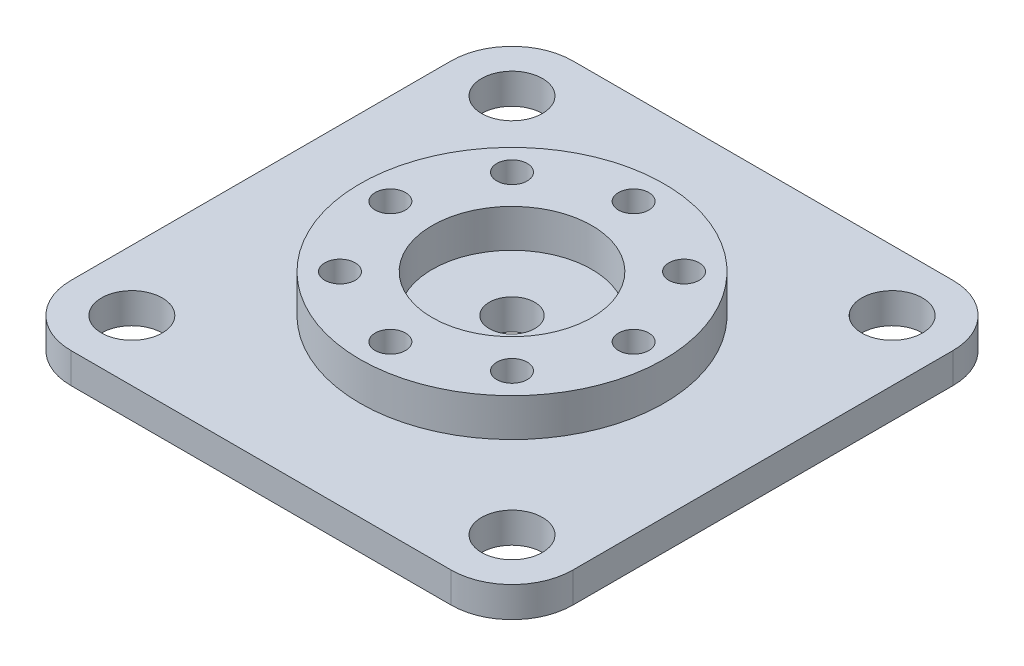
ISO-10303-21;
HEADER;
FILE_DESCRIPTION(('STEP AP214'),'2;1');
FILE_NAME('part.step','',(''),(''),'','','');
FILE_SCHEMA(('AUTOMOTIVE_DESIGN { 1 0 10303 214 1 1 1 1 }'));
ENDSEC;
DATA;
#1=APPLICATION_CONTEXT('core data for automotive mechanical design processes');
#2=APPLICATION_PROTOCOL_DEFINITION('international standard','automotive_design',2000,#1);
#3=PRODUCT_CONTEXT('',#1,'mechanical');
#4=PRODUCT('Part','Part','',(#3));
#5=PRODUCT_RELATED_PRODUCT_CATEGORY('part','',(#4));
#6=PRODUCT_DEFINITION_FORMATION('','',#4);
#7=PRODUCT_DEFINITION_CONTEXT('part definition',#1,'design');
#8=PRODUCT_DEFINITION('design','',#6,#7);
#9=PRODUCT_DEFINITION_SHAPE('','',#8);
#10=(LENGTH_UNIT() NAMED_UNIT(*) SI_UNIT(.MILLI.,.METRE.));
#11=(NAMED_UNIT(*) PLANE_ANGLE_UNIT() SI_UNIT($,.RADIAN.));
#12=(NAMED_UNIT(*) SI_UNIT($,.STERADIAN.) SOLID_ANGLE_UNIT());
#13=UNCERTAINTY_MEASURE_WITH_UNIT(LENGTH_MEASURE(1.E-05),#10,'distance_accuracy_value','');
#14=(GEOMETRIC_REPRESENTATION_CONTEXT(3) GLOBAL_UNCERTAINTY_ASSIGNED_CONTEXT((#13)) GLOBAL_UNIT_ASSIGNED_CONTEXT((#10,
#11,#12)) REPRESENTATION_CONTEXT('',''));
#15=CARTESIAN_POINT('',(0.,0.,0.));
#16=DIRECTION('',(0.,0.,1.));
#17=DIRECTION('',(1.,0.,0.));
#18=AXIS2_PLACEMENT_3D('',#15,#16,#17);
#19=CARTESIAN_POINT('',(0.,2.5,0.));
#20=DIRECTION('',(0.,1.,0.));
#21=DIRECTION('',(0.,0.,1.));
#22=AXIS2_PLACEMENT_3D('',#19,#20,#21);
#23=PLANE('',#22);
#24=CARTESIAN_POINT('',(-3.39590937005871E-13,2.5,-8.));
#25=DIRECTION('',(0.,1.,0.));
#26=DIRECTION('',(0.,0.,1.));
#27=AXIS2_PLACEMENT_3D('',#24,#25,#26);
#28=CIRCLE('',#27,1.);
#29=CARTESIAN_POINT('',(-3.39590937005871E-13,2.5,-7.));
#30=VERTEX_POINT('',#29);
#31=EDGE_CURVE('E101',#30,#30,#28,.T.);
#32=ORIENTED_EDGE('',*,*,#31,.F.);
#33=EDGE_LOOP('',(#32));
#34=FACE_BOUND('',#33,.T.);
#35=CARTESIAN_POINT('',(-8.,2.5,3.4109000346394E-13));
#36=DIRECTION('',(0.,1.,0.));
#37=DIRECTION('',(0.,0.,1.));
#38=AXIS2_PLACEMENT_3D('',#35,#36,#37);
#39=CIRCLE('',#38,1.);
#40=CARTESIAN_POINT('',(-8.,2.5,1.00000000000034));
#41=VERTEX_POINT('',#40);
#42=EDGE_CURVE('E89',#41,#41,#39,.T.);
#43=ORIENTED_EDGE('',*,*,#42,.F.);
#44=EDGE_LOOP('',(#43));
#45=FACE_BOUND('',#44,.T.);
#46=CARTESIAN_POINT('',(3.39590937005871E-13,2.5,8.));
#47=DIRECTION('',(0.,1.,0.));
#48=DIRECTION('',(0.,0.,1.));
#49=AXIS2_PLACEMENT_3D('',#46,#47,#48);
#50=CIRCLE('',#49,1.);
#51=CARTESIAN_POINT('',(3.39590937005871E-13,2.5,9.));
#52=VERTEX_POINT('',#51);
#53=EDGE_CURVE('E77',#52,#52,#50,.T.);
#54=ORIENTED_EDGE('',*,*,#53,.F.);
#55=EDGE_LOOP('',(#54));
#56=FACE_BOUND('',#55,.T.);
#57=CARTESIAN_POINT('',(8.,2.5,-3.40005801291454E-13));
#58=DIRECTION('',(0.,1.,0.));
#59=DIRECTION('',(0.,0.,1.));
#60=AXIS2_PLACEMENT_3D('',#57,#58,#59);
#61=CIRCLE('',#60,1.);
#62=CARTESIAN_POINT('',(8.,2.5,0.99999999999966));
#63=VERTEX_POINT('',#62);
#64=EDGE_CURVE('E65',#63,#63,#61,.T.);
#65=ORIENTED_EDGE('',*,*,#64,.F.);
#66=EDGE_LOOP('',(#65));
#67=FACE_BOUND('',#66,.T.);
#68=CARTESIAN_POINT('',(0.,2.5,0.));
#69=DIRECTION('',(0.,1.,0.));
#70=DIRECTION('',(0.,0.,1.));
#71=AXIS2_PLACEMENT_3D('',#68,#69,#70);
#72=CIRCLE('',#71,10.);
#73=CARTESIAN_POINT('',(0.,2.5,10.));
#74=VERTEX_POINT('',#73);
#75=EDGE_CURVE('E11',#74,#74,#72,.T.);
#76=ORIENTED_EDGE('',*,*,#75,.T.);
#77=EDGE_LOOP('',(#76));
#78=FACE_BOUND('',#77,.T.);
#79=CARTESIAN_POINT('',(5.65685424949214,2.5,-5.65685424949262));
#80=DIRECTION('',(0.,1.,0.));
#81=DIRECTION('',(0.,0.,1.));
#82=AXIS2_PLACEMENT_3D('',#79,#80,#81);
#83=CIRCLE('',#82,1.);
#84=CARTESIAN_POINT('',(5.65685424949214,2.5,-4.65685424949262));
#85=VERTEX_POINT('',#84);
#86=EDGE_CURVE('E60',#85,#85,#83,.T.);
#87=ORIENTED_EDGE('',*,*,#86,.F.);
#88=EDGE_LOOP('',(#87));
#89=FACE_BOUND('',#88,.T.);
#90=CARTESIAN_POINT('',(5.65685424949262,2.5,5.65685424949214));
#91=DIRECTION('',(0.,1.,0.));
#92=DIRECTION('',(0.,0.,1.));
#93=AXIS2_PLACEMENT_3D('',#90,#91,#92);
#94=CIRCLE('',#93,0.999999999999999);
#95=CARTESIAN_POINT('',(5.65685424949262,2.5,6.65685424949214));
#96=VERTEX_POINT('',#95);
#97=EDGE_CURVE('E71',#96,#96,#94,.T.);
#98=ORIENTED_EDGE('',*,*,#97,.F.);
#99=EDGE_LOOP('',(#98));
#100=FACE_BOUND('',#99,.T.);
#101=CARTESIAN_POINT('',(-5.65685424949214,2.5,5.65685424949262));
#102=DIRECTION('',(0.,1.,0.));
#103=DIRECTION('',(0.,0.,1.));
#104=AXIS2_PLACEMENT_3D('',#101,#102,#103);
#105=CIRCLE('',#104,1.);
#106=CARTESIAN_POINT('',(-5.65685424949214,2.5,6.65685424949262));
#107=VERTEX_POINT('',#106);
#108=EDGE_CURVE('E83',#107,#107,#105,.T.);
#109=ORIENTED_EDGE('',*,*,#108,.F.);
#110=EDGE_LOOP('',(#109));
#111=FACE_BOUND('',#110,.T.);
#112=CARTESIAN_POINT('',(-5.65685424949262,2.5,-5.65685424949214));
#113=DIRECTION('',(0.,1.,0.));
#114=DIRECTION('',(0.,0.,1.));
#115=AXIS2_PLACEMENT_3D('',#112,#113,#114);
#116=CIRCLE('',#115,1.);
#117=CARTESIAN_POINT('',(-5.65685424949262,2.5,-4.65685424949214));
#118=VERTEX_POINT('',#117);
#119=EDGE_CURVE('E95',#118,#118,#116,.T.);
#120=ORIENTED_EDGE('',*,*,#119,.F.);
#121=EDGE_LOOP('',(#120));
#122=FACE_BOUND('',#121,.T.);
#123=CARTESIAN_POINT('',(0.,2.5,0.));
#124=DIRECTION('',(0.,1.,0.));
#125=DIRECTION('',(0.,0.,1.));
#126=AXIS2_PLACEMENT_3D('',#123,#124,#125);
#127=CIRCLE('',#126,5.25);
#128=CARTESIAN_POINT('',(0.,2.5,5.25));
#129=VERTEX_POINT('',#128);
#130=EDGE_CURVE('E107',#129,#129,#127,.T.);
#131=ORIENTED_EDGE('',*,*,#130,.F.);
#132=EDGE_LOOP('',(#131));
#133=FACE_BOUND('',#132,.T.);
#134=ADVANCED_FACE('F49',(#34,#45,#56,#67,#78,#89,#100,#111,#122,#133),#23,.T.);
#135=CARTESIAN_POINT('',(0.,0.,0.));
#136=DIRECTION('',(0.,1.,0.));
#137=DIRECTION('',(0.,0.,1.));
#138=AXIS2_PLACEMENT_3D('',#135,#136,#137);
#139=PLANE('',#138);
#140=CARTESIAN_POINT('',(0.,0.,0.));
#141=DIRECTION('',(0.,1.,0.));
#142=DIRECTION('',(0.,0.,1.));
#143=AXIS2_PLACEMENT_3D('',#140,#141,#142);
#144=CIRCLE('',#143,10.);
#145=CARTESIAN_POINT('',(0.,0.,10.));
#146=VERTEX_POINT('',#145);
#147=EDGE_CURVE('E53',#146,#146,#144,.T.);
#148=ORIENTED_EDGE('',*,*,#147,.F.);
#149=EDGE_LOOP('',(#148));
#150=FACE_BOUND('',#149,.T.);
#151=CARTESIAN_POINT('',(5.65685424949214,0.,-5.65685424949262));
#152=DIRECTION('',(0.,1.,0.));
#153=DIRECTION('',(0.,0.,1.));
#154=AXIS2_PLACEMENT_3D('',#151,#152,#153);
#155=CIRCLE('',#154,1.);
#156=CARTESIAN_POINT('',(5.65685424949214,0.,-4.65685424949262));
#157=VERTEX_POINT('',#156);
#158=EDGE_CURVE('E62',#157,#157,#155,.T.);
#159=ORIENTED_EDGE('',*,*,#158,.T.);
#160=EDGE_LOOP('',(#159));
#161=FACE_BOUND('',#160,.T.);
#162=CARTESIAN_POINT('',(8.,0.,-3.40005801291454E-13));
#163=DIRECTION('',(0.,1.,0.));
#164=DIRECTION('',(0.,0.,1.));
#165=AXIS2_PLACEMENT_3D('',#162,#163,#164);
#166=CIRCLE('',#165,1.);
#167=CARTESIAN_POINT('',(8.,0.,0.99999999999966));
#168=VERTEX_POINT('',#167);
#169=EDGE_CURVE('E68',#168,#168,#166,.T.);
#170=ORIENTED_EDGE('',*,*,#169,.T.);
#171=EDGE_LOOP('',(#170));
#172=FACE_BOUND('',#171,.T.);
#173=CARTESIAN_POINT('',(5.65685424949262,0.,5.65685424949214));
#174=DIRECTION('',(0.,1.,0.));
#175=DIRECTION('',(0.,0.,1.));
#176=AXIS2_PLACEMENT_3D('',#173,#174,#175);
#177=CIRCLE('',#176,0.999999999999999);
#178=CARTESIAN_POINT('',(5.65685424949262,0.,6.65685424949214));
#179=VERTEX_POINT('',#178);
#180=EDGE_CURVE('E74',#179,#179,#177,.T.);
#181=ORIENTED_EDGE('',*,*,#180,.T.);
#182=EDGE_LOOP('',(#181));
#183=FACE_BOUND('',#182,.T.);
#184=CARTESIAN_POINT('',(3.39590937005871E-13,0.,8.));
#185=DIRECTION('',(0.,1.,0.));
#186=DIRECTION('',(0.,0.,1.));
#187=AXIS2_PLACEMENT_3D('',#184,#185,#186);
#188=CIRCLE('',#187,1.);
#189=CARTESIAN_POINT('',(3.39590937005871E-13,0.,9.));
#190=VERTEX_POINT('',#189);
#191=EDGE_CURVE('E80',#190,#190,#188,.T.);
#192=ORIENTED_EDGE('',*,*,#191,.T.);
#193=EDGE_LOOP('',(#192));
#194=FACE_BOUND('',#193,.T.);
#195=CARTESIAN_POINT('',(-5.65685424949214,0.,5.65685424949262));
#196=DIRECTION('',(0.,1.,0.));
#197=DIRECTION('',(0.,0.,1.));
#198=AXIS2_PLACEMENT_3D('',#195,#196,#197);
#199=CIRCLE('',#198,1.);
#200=CARTESIAN_POINT('',(-5.65685424949214,0.,6.65685424949262));
#201=VERTEX_POINT('',#200);
#202=EDGE_CURVE('E86',#201,#201,#199,.T.);
#203=ORIENTED_EDGE('',*,*,#202,.T.);
#204=EDGE_LOOP('',(#203));
#205=FACE_BOUND('',#204,.T.);
#206=CARTESIAN_POINT('',(-8.,0.,3.4109000346394E-13));
#207=DIRECTION('',(0.,1.,0.));
#208=DIRECTION('',(0.,0.,1.));
#209=AXIS2_PLACEMENT_3D('',#206,#207,#208);
#210=CIRCLE('',#209,1.);
#211=CARTESIAN_POINT('',(-8.,0.,1.00000000000034));
#212=VERTEX_POINT('',#211);
#213=EDGE_CURVE('E92',#212,#212,#210,.T.);
#214=ORIENTED_EDGE('',*,*,#213,.T.);
#215=EDGE_LOOP('',(#214));
#216=FACE_BOUND('',#215,.T.);
#217=CARTESIAN_POINT('',(-5.65685424949262,0.,-5.65685424949214));
#218=DIRECTION('',(0.,1.,0.));
#219=DIRECTION('',(0.,0.,1.));
#220=AXIS2_PLACEMENT_3D('',#217,#218,#219);
#221=CIRCLE('',#220,1.);
#222=CARTESIAN_POINT('',(-5.65685424949262,0.,-4.65685424949214));
#223=VERTEX_POINT('',#222);
#224=EDGE_CURVE('E98',#223,#223,#221,.T.);
#225=ORIENTED_EDGE('',*,*,#224,.T.);
#226=EDGE_LOOP('',(#225));
#227=FACE_BOUND('',#226,.T.);
#228=CARTESIAN_POINT('',(-3.39590937005871E-13,0.,-8.));
#229=DIRECTION('',(0.,1.,0.));
#230=DIRECTION('',(0.,0.,1.));
#231=AXIS2_PLACEMENT_3D('',#228,#229,#230);
#232=CIRCLE('',#231,1.);
#233=CARTESIAN_POINT('',(-3.39590937005871E-13,0.,-7.));
#234=VERTEX_POINT('',#233);
#235=EDGE_CURVE('E104',#234,#234,#232,.T.);
#236=ORIENTED_EDGE('',*,*,#235,.T.);
#237=EDGE_LOOP('',(#236));
#238=FACE_BOUND('',#237,.T.);
#239=CARTESIAN_POINT('',(0.,0.,0.));
#240=DIRECTION('',(0.,1.,0.));
#241=DIRECTION('',(0.,0.,1.));
#242=AXIS2_PLACEMENT_3D('',#239,#240,#241);
#243=CIRCLE('',#242,5.25);
#244=CARTESIAN_POINT('',(0.,0.,5.25));
#245=VERTEX_POINT('',#244);
#246=EDGE_CURVE('E110',#245,#245,#243,.T.);
#247=ORIENTED_EDGE('',*,*,#246,.T.);
#248=EDGE_LOOP('',(#247));
#249=FACE_BOUND('',#248,.T.);
#250=ADVANCED_FACE('F120',(#150,#161,#172,#183,#194,#205,#216,#227,#238,#249),#139,.F.);
#251=CARTESIAN_POINT('',(0.,2.5,0.));
#252=DIRECTION('',(0.,-1.,0.));
#253=DIRECTION('',(0.,0.,-1.));
#254=AXIS2_PLACEMENT_3D('',#251,#252,#253);
#255=CYLINDRICAL_SURFACE('',#254,10.);
#256=ORIENTED_EDGE('',*,*,#75,.F.);
#257=EDGE_LOOP('',(#256));
#258=FACE_BOUND('',#257,.T.);
#259=ORIENTED_EDGE('',*,*,#147,.T.);
#260=EDGE_LOOP('',(#259));
#261=FACE_BOUND('',#260,.T.);
#262=ADVANCED_FACE('F51',(#258,#261),#255,.T.);
#263=CARTESIAN_POINT('',(5.65685424949214,2.5,-5.65685424949262));
#264=DIRECTION('',(0.,-1.,0.));
#265=DIRECTION('',(0.,0.,-1.));
#266=AXIS2_PLACEMENT_3D('',#263,#264,#265);
#267=CYLINDRICAL_SURFACE('',#266,1.);
#268=ORIENTED_EDGE('',*,*,#86,.T.);
#269=EDGE_LOOP('',(#268));
#270=FACE_BOUND('',#269,.T.);
#271=ORIENTED_EDGE('',*,*,#158,.F.);
#272=EDGE_LOOP('',(#271));
#273=FACE_BOUND('',#272,.T.);
#274=ADVANCED_FACE('F130',(#270,#273),#267,.F.);
#275=CARTESIAN_POINT('',(8.,2.5,-3.40005801291454E-13));
#276=DIRECTION('',(0.,-1.,0.));
#277=DIRECTION('',(0.,0.,-1.));
#278=AXIS2_PLACEMENT_3D('',#275,#276,#277);
#279=CYLINDRICAL_SURFACE('',#278,1.);
#280=ORIENTED_EDGE('',*,*,#64,.T.);
#281=EDGE_LOOP('',(#280));
#282=FACE_BOUND('',#281,.T.);
#283=ORIENTED_EDGE('',*,*,#169,.F.);
#284=EDGE_LOOP('',(#283));
#285=FACE_BOUND('',#284,.T.);
#286=ADVANCED_FACE('F133',(#282,#285),#279,.F.);
#287=CARTESIAN_POINT('',(5.65685424949262,2.5,5.65685424949214));
#288=DIRECTION('',(0.,-1.,0.));
#289=DIRECTION('',(0.,0.,-1.));
#290=AXIS2_PLACEMENT_3D('',#287,#288,#289);
#291=CYLINDRICAL_SURFACE('',#290,0.999999999999999);
#292=ORIENTED_EDGE('',*,*,#97,.T.);
#293=EDGE_LOOP('',(#292));
#294=FACE_BOUND('',#293,.T.);
#295=ORIENTED_EDGE('',*,*,#180,.F.);
#296=EDGE_LOOP('',(#295));
#297=FACE_BOUND('',#296,.T.);
#298=ADVANCED_FACE('F137',(#294,#297),#291,.F.);
#299=CARTESIAN_POINT('',(3.39590937005871E-13,2.5,8.));
#300=DIRECTION('',(0.,-1.,0.));
#301=DIRECTION('',(0.,0.,-1.));
#302=AXIS2_PLACEMENT_3D('',#299,#300,#301);
#303=CYLINDRICAL_SURFACE('',#302,1.);
#304=ORIENTED_EDGE('',*,*,#53,.T.);
#305=EDGE_LOOP('',(#304));
#306=FACE_BOUND('',#305,.T.);
#307=ORIENTED_EDGE('',*,*,#191,.F.);
#308=EDGE_LOOP('',(#307));
#309=FACE_BOUND('',#308,.T.);
#310=ADVANCED_FACE('F141',(#306,#309),#303,.F.);
#311=CARTESIAN_POINT('',(-5.65685424949214,2.5,5.65685424949262));
#312=DIRECTION('',(0.,-1.,0.));
#313=DIRECTION('',(0.,0.,-1.));
#314=AXIS2_PLACEMENT_3D('',#311,#312,#313);
#315=CYLINDRICAL_SURFACE('',#314,1.);
#316=ORIENTED_EDGE('',*,*,#108,.T.);
#317=EDGE_LOOP('',(#316));
#318=FACE_BOUND('',#317,.T.);
#319=ORIENTED_EDGE('',*,*,#202,.F.);
#320=EDGE_LOOP('',(#319));
#321=FACE_BOUND('',#320,.T.);
#322=ADVANCED_FACE('F145',(#318,#321),#315,.F.);
#323=CARTESIAN_POINT('',(-8.,2.5,3.4109000346394E-13));
#324=DIRECTION('',(0.,-1.,0.));
#325=DIRECTION('',(0.,0.,-1.));
#326=AXIS2_PLACEMENT_3D('',#323,#324,#325);
#327=CYLINDRICAL_SURFACE('',#326,1.);
#328=ORIENTED_EDGE('',*,*,#42,.T.);
#329=EDGE_LOOP('',(#328));
#330=FACE_BOUND('',#329,.T.);
#331=ORIENTED_EDGE('',*,*,#213,.F.);
#332=EDGE_LOOP('',(#331));
#333=FACE_BOUND('',#332,.T.);
#334=ADVANCED_FACE('F149',(#330,#333),#327,.F.);
#335=CARTESIAN_POINT('',(-5.65685424949262,2.5,-5.65685424949214));
#336=DIRECTION('',(0.,-1.,0.));
#337=DIRECTION('',(0.,0.,-1.));
#338=AXIS2_PLACEMENT_3D('',#335,#336,#337);
#339=CYLINDRICAL_SURFACE('',#338,1.);
#340=ORIENTED_EDGE('',*,*,#119,.T.);
#341=EDGE_LOOP('',(#340));
#342=FACE_BOUND('',#341,.T.);
#343=ORIENTED_EDGE('',*,*,#224,.F.);
#344=EDGE_LOOP('',(#343));
#345=FACE_BOUND('',#344,.T.);
#346=ADVANCED_FACE('F153',(#342,#345),#339,.F.);
#347=CARTESIAN_POINT('',(-3.39590937005871E-13,2.5,-8.));
#348=DIRECTION('',(0.,-1.,0.));
#349=DIRECTION('',(0.,0.,-1.));
#350=AXIS2_PLACEMENT_3D('',#347,#348,#349);
#351=CYLINDRICAL_SURFACE('',#350,1.);
#352=ORIENTED_EDGE('',*,*,#31,.T.);
#353=EDGE_LOOP('',(#352));
#354=FACE_BOUND('',#353,.T.);
#355=ORIENTED_EDGE('',*,*,#235,.F.);
#356=EDGE_LOOP('',(#355));
#357=FACE_BOUND('',#356,.T.);
#358=ADVANCED_FACE('F157',(#354,#357),#351,.F.);
#359=CARTESIAN_POINT('',(0.,2.5,0.));
#360=DIRECTION('',(0.,-1.,0.));
#361=DIRECTION('',(0.,0.,-1.));
#362=AXIS2_PLACEMENT_3D('',#359,#360,#361);
#363=CYLINDRICAL_SURFACE('',#362,5.25);
#364=ORIENTED_EDGE('',*,*,#130,.T.);
#365=EDGE_LOOP('',(#364));
#366=FACE_BOUND('',#365,.T.);
#367=ORIENTED_EDGE('',*,*,#246,.F.);
#368=EDGE_LOOP('',(#367));
#369=FACE_BOUND('',#368,.T.);
#370=ADVANCED_FACE('F116',(#366,#369),#363,.F.);
#371=CLOSED_SHELL('',(#134,#250,#262,#274,#286,#298,#310,#322,#334,#346,#358,#370));
#372=MANIFOLD_SOLID_BREP('B2',#371);
#373=CARTESIAN_POINT('',(-16.5,-2.,16.5));
#374=DIRECTION('',(-1.,0.,0.));
#375=DIRECTION('',(0.,0.,1.));
#376=AXIS2_PLACEMENT_3D('',#373,#374,#375);
#377=PLANE('',#376);
#378=DIRECTION('',(0.,0.,1.));
#379=VECTOR('',#378,1.);
#380=CARTESIAN_POINT('',(-16.5,-2.,16.5));
#381=LINE('',#380,#379);
#382=CARTESIAN_POINT('',(-16.5,-2.,-12.5));
#383=VERTEX_POINT('',#382);
#384=CARTESIAN_POINT('',(-16.5,-2.,12.5));
#385=VERTEX_POINT('',#384);
#386=EDGE_CURVE('E454',#383,#385,#381,.T.);
#387=ORIENTED_EDGE('',*,*,#386,.T.);
#388=DIRECTION('',(0.,1.,0.));
#389=VECTOR('',#388,1.);
#390=CARTESIAN_POINT('',(-16.5,-2.,12.5));
#391=LINE('',#390,#389);
#392=CARTESIAN_POINT('',(-16.5,0.,12.5));
#393=VERTEX_POINT('',#392);
#394=EDGE_CURVE('E382',#385,#393,#391,.T.);
#395=ORIENTED_EDGE('',*,*,#394,.T.);
#396=DIRECTION('',(0.,0.,1.));
#397=VECTOR('',#396,1.);
#398=CARTESIAN_POINT('',(-16.5,0.,16.5));
#399=LINE('',#398,#397);
#400=CARTESIAN_POINT('',(-16.5,0.,-12.5));
#401=VERTEX_POINT('',#400);
#402=EDGE_CURVE('E373',#401,#393,#399,.T.);
#403=ORIENTED_EDGE('',*,*,#402,.F.);
#404=DIRECTION('',(0.,1.,0.));
#405=VECTOR('',#404,1.);
#406=CARTESIAN_POINT('',(-16.5,-2.,-12.5));
#407=LINE('',#406,#405);
#408=EDGE_CURVE('E387',#401,#383,#407,.F.);
#409=ORIENTED_EDGE('',*,*,#408,.T.);
#410=EDGE_LOOP('',(#387,#395,#403,#409));
#411=FACE_BOUND('',#410,.T.);
#412=ADVANCED_FACE('F303',(#411),#377,.T.);
#413=CARTESIAN_POINT('',(16.5,-2.,-16.5));
#414=DIRECTION('',(0.,0.,-1.));
#415=DIRECTION('',(-1.,0.,0.));
#416=AXIS2_PLACEMENT_3D('',#413,#414,#415);
#417=PLANE('',#416);
#418=DIRECTION('',(-1.,0.,0.));
#419=VECTOR('',#418,1.);
#420=CARTESIAN_POINT('',(16.5,0.,-16.5));
#421=LINE('',#420,#419);
#422=CARTESIAN_POINT('',(12.5,0.,-16.5));
#423=VERTEX_POINT('',#422);
#424=CARTESIAN_POINT('',(-12.5,0.,-16.5));
#425=VERTEX_POINT('',#424);
#426=EDGE_CURVE('E375',#423,#425,#421,.T.);
#427=ORIENTED_EDGE('',*,*,#426,.F.);
#428=DIRECTION('',(0.,1.,0.));
#429=VECTOR('',#428,1.);
#430=CARTESIAN_POINT('',(12.5,-2.,-16.5));
#431=LINE('',#430,#429);
#432=CARTESIAN_POINT('',(12.5,-2.,-16.5));
#433=VERTEX_POINT('',#432);
#434=EDGE_CURVE('E47',#423,#433,#431,.F.);
#435=ORIENTED_EDGE('',*,*,#434,.T.);
#436=DIRECTION('',(-1.,0.,0.));
#437=VECTOR('',#436,1.);
#438=CARTESIAN_POINT('',(16.5,-2.,-16.5));
#439=LINE('',#438,#437);
#440=CARTESIAN_POINT('',(-12.5,-2.,-16.5));
#441=VERTEX_POINT('',#440);
#442=EDGE_CURVE('E397',#433,#441,#439,.T.);
#443=ORIENTED_EDGE('',*,*,#442,.T.);
#444=DIRECTION('',(0.,1.,0.));
#445=VECTOR('',#444,1.);
#446=CARTESIAN_POINT('',(-12.5,-2.,-16.5));
#447=LINE('',#446,#445);
#448=EDGE_CURVE('E312',#441,#425,#447,.T.);
#449=ORIENTED_EDGE('',*,*,#448,.T.);
#450=EDGE_LOOP('',(#427,#435,#443,#449));
#451=FACE_BOUND('',#450,.T.);
#452=ADVANCED_FACE('F440',(#451),#417,.T.);
#453=CARTESIAN_POINT('',(16.5,-2.,16.5));
#454=DIRECTION('',(1.,0.,0.));
#455=DIRECTION('',(0.,0.,-1.));
#456=AXIS2_PLACEMENT_3D('',#453,#454,#455);
#457=PLANE('',#456);
#458=DIRECTION('',(0.,0.,-1.));
#459=VECTOR('',#458,1.);
#460=CARTESIAN_POINT('',(16.5,0.,16.5));
#461=LINE('',#460,#459);
#462=CARTESIAN_POINT('',(16.5,0.,12.5));
#463=VERTEX_POINT('',#462);
#464=CARTESIAN_POINT('',(16.5,0.,-12.5));
#465=VERTEX_POINT('',#464);
#466=EDGE_CURVE('E449',#463,#465,#461,.T.);
#467=ORIENTED_EDGE('',*,*,#466,.F.);
#468=DIRECTION('',(0.,1.,0.));
#469=VECTOR('',#468,1.);
#470=CARTESIAN_POINT('',(16.5,-2.,12.5));
#471=LINE('',#470,#469);
#472=CARTESIAN_POINT('',(16.5,-2.,12.5));
#473=VERTEX_POINT('',#472);
#474=EDGE_CURVE('E326',#463,#473,#471,.F.);
#475=ORIENTED_EDGE('',*,*,#474,.T.);
#476=DIRECTION('',(0.,0.,-1.));
#477=VECTOR('',#476,1.);
#478=CARTESIAN_POINT('',(16.5,-2.,16.5));
#479=LINE('',#478,#477);
#480=CARTESIAN_POINT('',(16.5,-2.,-12.5));
#481=VERTEX_POINT('',#480);
#482=EDGE_CURVE('E403',#473,#481,#479,.T.);
#483=ORIENTED_EDGE('',*,*,#482,.T.);
#484=DIRECTION('',(0.,1.,0.));
#485=VECTOR('',#484,1.);
#486=CARTESIAN_POINT('',(16.5,-2.,-12.5));
#487=LINE('',#486,#485);
#488=EDGE_CURVE('E433',#481,#465,#487,.T.);
#489=ORIENTED_EDGE('',*,*,#488,.T.);
#490=EDGE_LOOP('',(#467,#475,#483,#489));
#491=FACE_BOUND('',#490,.T.);
#492=ADVANCED_FACE('F448',(#491),#457,.T.);
#493=CARTESIAN_POINT('',(16.5,-2.,16.5));
#494=DIRECTION('',(0.,0.,1.));
#495=DIRECTION('',(1.,0.,0.));
#496=AXIS2_PLACEMENT_3D('',#493,#494,#495);
#497=PLANE('',#496);
#498=DIRECTION('',(1.,0.,0.));
#499=VECTOR('',#498,1.);
#500=CARTESIAN_POINT('',(16.5,0.,16.5));
#501=LINE('',#500,#499);
#502=CARTESIAN_POINT('',(-12.5,0.,16.5));
#503=VERTEX_POINT('',#502);
#504=CARTESIAN_POINT('',(12.5,0.,16.5));
#505=VERTEX_POINT('',#504);
#506=EDGE_CURVE('E391',#503,#505,#501,.T.);
#507=ORIENTED_EDGE('',*,*,#506,.F.);
#508=DIRECTION('',(0.,1.,0.));
#509=VECTOR('',#508,1.);
#510=CARTESIAN_POINT('',(-12.5,-2.,16.5));
#511=LINE('',#510,#509);
#512=CARTESIAN_POINT('',(-12.5,-2.,16.5));
#513=VERTEX_POINT('',#512);
#514=EDGE_CURVE('E420',#503,#513,#511,.F.);
#515=ORIENTED_EDGE('',*,*,#514,.T.);
#516=DIRECTION('',(1.,0.,0.));
#517=VECTOR('',#516,1.);
#518=CARTESIAN_POINT('',(16.5,-2.,16.5));
#519=LINE('',#518,#517);
#520=CARTESIAN_POINT('',(12.5,-2.,16.5));
#521=VERTEX_POINT('',#520);
#522=EDGE_CURVE('E459',#513,#521,#519,.T.);
#523=ORIENTED_EDGE('',*,*,#522,.T.);
#524=DIRECTION('',(0.,1.,0.));
#525=VECTOR('',#524,1.);
#526=CARTESIAN_POINT('',(12.5,-2.,16.5));
#527=LINE('',#526,#525);
#528=EDGE_CURVE('E416',#521,#505,#527,.T.);
#529=ORIENTED_EDGE('',*,*,#528,.T.);
#530=EDGE_LOOP('',(#507,#515,#523,#529));
#531=FACE_BOUND('',#530,.T.);
#532=ADVANCED_FACE('F613',(#531),#497,.T.);
#533=CARTESIAN_POINT('',(0.,-2.,0.));
#534=DIRECTION('',(0.,1.,0.));
#535=DIRECTION('',(0.,0.,1.));
#536=AXIS2_PLACEMENT_3D('',#533,#534,#535);
#537=PLANE('',#536);
#538=CARTESIAN_POINT('',(-5.65685424949262,-2.,-5.65685424949214));
#539=DIRECTION('',(0.,1.,0.));
#540=DIRECTION('',(0.,0.,1.));
#541=AXIS2_PLACEMENT_3D('',#538,#539,#540);
#542=CIRCLE('',#541,1.);
#543=CARTESIAN_POINT('',(-5.65685424949262,-2.,-4.65685424949214));
#544=VERTEX_POINT('',#543);
#545=EDGE_CURVE('E509',#544,#544,#542,.T.);
#546=ORIENTED_EDGE('',*,*,#545,.T.);
#547=EDGE_LOOP('',(#546));
#548=FACE_BOUND('',#547,.T.);
#549=CARTESIAN_POINT('',(-8.,-2.,3.4109000346394E-13));
#550=DIRECTION('',(0.,1.,0.));
#551=DIRECTION('',(0.,0.,1.));
#552=AXIS2_PLACEMENT_3D('',#549,#550,#551);
#553=CIRCLE('',#552,1.);
#554=CARTESIAN_POINT('',(-8.,-2.,1.00000000000034));
#555=VERTEX_POINT('',#554);
#556=EDGE_CURVE('E518',#555,#555,#553,.T.);
#557=ORIENTED_EDGE('',*,*,#556,.T.);
#558=EDGE_LOOP('',(#557));
#559=FACE_BOUND('',#558,.T.);
#560=CARTESIAN_POINT('',(-5.65685424949214,-2.,5.65685424949262));
#561=DIRECTION('',(0.,1.,0.));
#562=DIRECTION('',(0.,0.,1.));
#563=AXIS2_PLACEMENT_3D('',#560,#561,#562);
#564=CIRCLE('',#563,1.);
#565=CARTESIAN_POINT('',(-5.65685424949214,-2.,6.65685424949262));
#566=VERTEX_POINT('',#565);
#567=EDGE_CURVE('E526',#566,#566,#564,.T.);
#568=ORIENTED_EDGE('',*,*,#567,.T.);
#569=EDGE_LOOP('',(#568));
#570=FACE_BOUND('',#569,.T.);
#571=CARTESIAN_POINT('',(3.39590937005871E-13,-2.,8.));
#572=DIRECTION('',(0.,1.,0.));
#573=DIRECTION('',(0.,0.,1.));
#574=AXIS2_PLACEMENT_3D('',#571,#572,#573);
#575=CIRCLE('',#574,1.);
#576=CARTESIAN_POINT('',(3.39590937005871E-13,-2.,9.));
#577=VERTEX_POINT('',#576);
#578=EDGE_CURVE('E478',#577,#577,#575,.T.);
#579=ORIENTED_EDGE('',*,*,#578,.T.);
#580=EDGE_LOOP('',(#579));
#581=FACE_BOUND('',#580,.T.);
#582=CARTESIAN_POINT('',(5.65685424949262,-2.,5.65685424949214));
#583=DIRECTION('',(0.,1.,0.));
#584=DIRECTION('',(0.,0.,1.));
#585=AXIS2_PLACEMENT_3D('',#582,#583,#584);
#586=CIRCLE('',#585,0.999999999999999);
#587=CARTESIAN_POINT('',(5.65685424949262,-2.,6.65685424949214));
#588=VERTEX_POINT('',#587);
#589=EDGE_CURVE('E477',#588,#588,#586,.T.);
#590=ORIENTED_EDGE('',*,*,#589,.T.);
#591=EDGE_LOOP('',(#590));
#592=FACE_BOUND('',#591,.T.);
#593=CARTESIAN_POINT('',(8.,-2.,-3.40005801291454E-13));
#594=DIRECTION('',(0.,1.,0.));
#595=DIRECTION('',(0.,0.,1.));
#596=AXIS2_PLACEMENT_3D('',#593,#594,#595);
#597=CIRCLE('',#596,1.);
#598=CARTESIAN_POINT('',(8.,-2.,0.99999999999966));
#599=VERTEX_POINT('',#598);
#600=EDGE_CURVE('E486',#599,#599,#597,.T.);
#601=ORIENTED_EDGE('',*,*,#600,.T.);
#602=EDGE_LOOP('',(#601));
#603=FACE_BOUND('',#602,.T.);
#604=CARTESIAN_POINT('',(5.65685424949214,-2.,-5.65685424949262));
#605=DIRECTION('',(0.,1.,0.));
#606=DIRECTION('',(0.,0.,1.));
#607=AXIS2_PLACEMENT_3D('',#604,#605,#606);
#608=CIRCLE('',#607,1.);
#609=CARTESIAN_POINT('',(5.65685424949214,-2.,-4.65685424949262));
#610=VERTEX_POINT('',#609);
#611=EDGE_CURVE('E494',#610,#610,#608,.T.);
#612=ORIENTED_EDGE('',*,*,#611,.T.);
#613=EDGE_LOOP('',(#612));
#614=FACE_BOUND('',#613,.T.);
#615=CARTESIAN_POINT('',(-12.5,-2.,-12.5));
#616=DIRECTION('',(0.,1.,0.));
#617=DIRECTION('',(0.,0.,1.));
#618=AXIS2_PLACEMENT_3D('',#615,#616,#617);
#619=CIRCLE('',#618,2.);
#620=CARTESIAN_POINT('',(-12.5,-2.,-10.5));
#621=VERTEX_POINT('',#620);
#622=EDGE_CURVE('E469',#621,#621,#619,.T.);
#623=ORIENTED_EDGE('',*,*,#622,.T.);
#624=EDGE_LOOP('',(#623));
#625=FACE_BOUND('',#624,.T.);
#626=CARTESIAN_POINT('',(12.5,-2.,-12.5));
#627=DIRECTION('',(0.,1.,0.));
#628=DIRECTION('',(0.,0.,1.));
#629=AXIS2_PLACEMENT_3D('',#626,#627,#628);
#630=CIRCLE('',#629,2.);
#631=CARTESIAN_POINT('',(12.5,-2.,-10.5));
#632=VERTEX_POINT('',#631);
#633=EDGE_CURVE('E510',#632,#632,#630,.T.);
#634=ORIENTED_EDGE('',*,*,#633,.T.);
#635=EDGE_LOOP('',(#634));
#636=FACE_BOUND('',#635,.T.);
#637=CARTESIAN_POINT('',(12.5,-2.,12.5));
#638=DIRECTION('',(0.,1.,0.));
#639=DIRECTION('',(0.,0.,1.));
#640=AXIS2_PLACEMENT_3D('',#637,#638,#639);
#641=CIRCLE('',#640,2.);
#642=CARTESIAN_POINT('',(12.5,-2.,14.5));
#643=VERTEX_POINT('',#642);
#644=EDGE_CURVE('E557',#643,#643,#641,.T.);
#645=ORIENTED_EDGE('',*,*,#644,.T.);
#646=EDGE_LOOP('',(#645));
#647=FACE_BOUND('',#646,.T.);
#648=CARTESIAN_POINT('',(-12.5,-2.,12.5));
#649=DIRECTION('',(0.,1.,0.));
#650=DIRECTION('',(0.,0.,1.));
#651=AXIS2_PLACEMENT_3D('',#648,#649,#650);
#652=CIRCLE('',#651,2.);
#653=CARTESIAN_POINT('',(-12.5,-2.,14.5));
#654=VERTEX_POINT('',#653);
#655=EDGE_CURVE('E549',#654,#654,#652,.T.);
#656=ORIENTED_EDGE('',*,*,#655,.T.);
#657=EDGE_LOOP('',(#656));
#658=FACE_BOUND('',#657,.T.);
#659=CARTESIAN_POINT('',(0.,-2.,0.));
#660=DIRECTION('',(0.,1.,0.));
#661=DIRECTION('',(0.,0.,1.));
#662=AXIS2_PLACEMENT_3D('',#659,#660,#661);
#663=CIRCLE('',#662,1.5);
#664=CARTESIAN_POINT('',(0.,-2.,1.5));
#665=VERTEX_POINT('',#664);
#666=EDGE_CURVE('E541',#665,#665,#663,.T.);
#667=ORIENTED_EDGE('',*,*,#666,.T.);
#668=EDGE_LOOP('',(#667));
#669=FACE_BOUND('',#668,.T.);
#670=CARTESIAN_POINT('',(-3.39590937005871E-13,-2.,-8.));
#671=DIRECTION('',(0.,1.,0.));
#672=DIRECTION('',(0.,0.,1.));
#673=AXIS2_PLACEMENT_3D('',#670,#671,#672);
#674=CIRCLE('',#673,1.);
#675=CARTESIAN_POINT('',(-3.39590937005871E-13,-2.,-7.));
#676=VERTEX_POINT('',#675);
#677=EDGE_CURVE('E392',#676,#676,#674,.T.);
#678=ORIENTED_EDGE('',*,*,#677,.T.);
#679=EDGE_LOOP('',(#678));
#680=FACE_BOUND('',#679,.T.);
#681=ORIENTED_EDGE('',*,*,#522,.F.);
#682=CARTESIAN_POINT('',(-12.5,-2.,12.5));
#683=DIRECTION('',(0.,1.,0.));
#684=DIRECTION('',(0.,0.,1.));
#685=AXIS2_PLACEMENT_3D('',#682,#683,#684);
#686=CIRCLE('',#685,4.);
#687=EDGE_CURVE('E430',#513,#385,#686,.F.);
#688=ORIENTED_EDGE('',*,*,#687,.T.);
#689=ORIENTED_EDGE('',*,*,#386,.F.);
#690=CARTESIAN_POINT('',(-12.5,-2.,-12.5));
#691=DIRECTION('',(0.,1.,0.));
#692=DIRECTION('',(0.,0.,1.));
#693=AXIS2_PLACEMENT_3D('',#690,#691,#692);
#694=CIRCLE('',#693,4.);
#695=EDGE_CURVE('E395',#383,#441,#694,.F.);
#696=ORIENTED_EDGE('',*,*,#695,.T.);
#697=ORIENTED_EDGE('',*,*,#442,.F.);
#698=CARTESIAN_POINT('',(12.5,-2.,-12.5));
#699=DIRECTION('',(0.,1.,0.));
#700=DIRECTION('',(0.,0.,1.));
#701=AXIS2_PLACEMENT_3D('',#698,#699,#700);
#702=CIRCLE('',#701,4.);
#703=EDGE_CURVE('E319',#433,#481,#702,.F.);
#704=ORIENTED_EDGE('',*,*,#703,.T.);
#705=ORIENTED_EDGE('',*,*,#482,.F.);
#706=CARTESIAN_POINT('',(12.5,-2.,12.5));
#707=DIRECTION('',(0.,1.,0.));
#708=DIRECTION('',(0.,0.,1.));
#709=AXIS2_PLACEMENT_3D('',#706,#707,#708);
#710=CIRCLE('',#709,4.);
#711=EDGE_CURVE('E427',#473,#521,#710,.F.);
#712=ORIENTED_EDGE('',*,*,#711,.T.);
#713=EDGE_LOOP('',(#681,#688,#689,#696,#697,#704,#705,#712));
#714=FACE_BOUND('',#713,.T.);
#715=ADVANCED_FACE('F443',(#548,#559,#570,#581,#592,#603,#614,#625,#636,#647,#658,#669,#680,
#714),#537,.F.);
#716=CARTESIAN_POINT('',(0.,0.,0.));
#717=DIRECTION('',(0.,1.,0.));
#718=DIRECTION('',(0.,0.,1.));
#719=AXIS2_PLACEMENT_3D('',#716,#717,#718);
#720=PLANE('',#719);
#721=CARTESIAN_POINT('',(-5.65685424949262,0.,-5.65685424949214));
#722=DIRECTION('',(0.,1.,0.));
#723=DIRECTION('',(0.,0.,1.));
#724=AXIS2_PLACEMENT_3D('',#721,#722,#723);
#725=CIRCLE('',#724,1.);
#726=CARTESIAN_POINT('',(-5.65685424949262,0.,-4.65685424949214));
#727=VERTEX_POINT('',#726);
#728=EDGE_CURVE('E505',#727,#727,#725,.T.);
#729=ORIENTED_EDGE('',*,*,#728,.F.);
#730=EDGE_LOOP('',(#729));
#731=FACE_BOUND('',#730,.T.);
#732=CARTESIAN_POINT('',(-8.,0.,3.4109000346394E-13));
#733=DIRECTION('',(0.,1.,0.));
#734=DIRECTION('',(0.,0.,1.));
#735=AXIS2_PLACEMENT_3D('',#732,#733,#734);
#736=CIRCLE('',#735,1.);
#737=CARTESIAN_POINT('',(-8.,0.,1.00000000000034));
#738=VERTEX_POINT('',#737);
#739=EDGE_CURVE('E514',#738,#738,#736,.T.);
#740=ORIENTED_EDGE('',*,*,#739,.F.);
#741=EDGE_LOOP('',(#740));
#742=FACE_BOUND('',#741,.T.);
#743=CARTESIAN_POINT('',(-5.65685424949214,0.,5.65685424949262));
#744=DIRECTION('',(0.,1.,0.));
#745=DIRECTION('',(0.,0.,1.));
#746=AXIS2_PLACEMENT_3D('',#743,#744,#745);
#747=CIRCLE('',#746,1.);
#748=CARTESIAN_POINT('',(-5.65685424949214,0.,6.65685424949262));
#749=VERTEX_POINT('',#748);
#750=EDGE_CURVE('E522',#749,#749,#747,.T.);
#751=ORIENTED_EDGE('',*,*,#750,.F.);
#752=EDGE_LOOP('',(#751));
#753=FACE_BOUND('',#752,.T.);
#754=CARTESIAN_POINT('',(3.39590937005871E-13,0.,8.));
#755=DIRECTION('',(0.,1.,0.));
#756=DIRECTION('',(0.,0.,1.));
#757=AXIS2_PLACEMENT_3D('',#754,#755,#756);
#758=CIRCLE('',#757,1.);
#759=CARTESIAN_POINT('',(3.39590937005871E-13,0.,9.));
#760=VERTEX_POINT('',#759);
#761=EDGE_CURVE('E530',#760,#760,#758,.T.);
#762=ORIENTED_EDGE('',*,*,#761,.F.);
#763=EDGE_LOOP('',(#762));
#764=FACE_BOUND('',#763,.T.);
#765=CARTESIAN_POINT('',(5.65685424949262,0.,5.65685424949214));
#766=DIRECTION('',(0.,1.,0.));
#767=DIRECTION('',(0.,0.,1.));
#768=AXIS2_PLACEMENT_3D('',#765,#766,#767);
#769=CIRCLE('',#768,0.999999999999999);
#770=CARTESIAN_POINT('',(5.65685424949262,0.,6.65685424949214));
#771=VERTEX_POINT('',#770);
#772=EDGE_CURVE('E473',#771,#771,#769,.T.);
#773=ORIENTED_EDGE('',*,*,#772,.F.);
#774=EDGE_LOOP('',(#773));
#775=FACE_BOUND('',#774,.T.);
#776=CARTESIAN_POINT('',(8.,0.,-3.40005801291454E-13));
#777=DIRECTION('',(0.,1.,0.));
#778=DIRECTION('',(0.,0.,1.));
#779=AXIS2_PLACEMENT_3D('',#776,#777,#778);
#780=CIRCLE('',#779,1.);
#781=CARTESIAN_POINT('',(8.,0.,0.99999999999966));
#782=VERTEX_POINT('',#781);
#783=EDGE_CURVE('E482',#782,#782,#780,.T.);
#784=ORIENTED_EDGE('',*,*,#783,.F.);
#785=EDGE_LOOP('',(#784));
#786=FACE_BOUND('',#785,.T.);
#787=CARTESIAN_POINT('',(5.65685424949214,0.,-5.65685424949262));
#788=DIRECTION('',(0.,1.,0.));
#789=DIRECTION('',(0.,0.,1.));
#790=AXIS2_PLACEMENT_3D('',#787,#788,#789);
#791=CIRCLE('',#790,1.);
#792=CARTESIAN_POINT('',(5.65685424949214,0.,-4.65685424949262));
#793=VERTEX_POINT('',#792);
#794=EDGE_CURVE('E490',#793,#793,#791,.T.);
#795=ORIENTED_EDGE('',*,*,#794,.F.);
#796=EDGE_LOOP('',(#795));
#797=FACE_BOUND('',#796,.T.);
#798=CARTESIAN_POINT('',(-12.5,0.,-12.5));
#799=DIRECTION('',(0.,1.,0.));
#800=DIRECTION('',(0.,0.,1.));
#801=AXIS2_PLACEMENT_3D('',#798,#799,#800);
#802=CIRCLE('',#801,2.);
#803=CARTESIAN_POINT('',(-12.5,0.,-10.5));
#804=VERTEX_POINT('',#803);
#805=EDGE_CURVE('E498',#804,#804,#802,.T.);
#806=ORIENTED_EDGE('',*,*,#805,.F.);
#807=EDGE_LOOP('',(#806));
#808=FACE_BOUND('',#807,.T.);
#809=CARTESIAN_POINT('',(12.5,0.,-12.5));
#810=DIRECTION('',(0.,1.,0.));
#811=DIRECTION('',(0.,0.,1.));
#812=AXIS2_PLACEMENT_3D('',#809,#810,#811);
#813=CIRCLE('',#812,2.);
#814=CARTESIAN_POINT('',(12.5,0.,-10.5));
#815=VERTEX_POINT('',#814);
#816=EDGE_CURVE('E561',#815,#815,#813,.T.);
#817=ORIENTED_EDGE('',*,*,#816,.F.);
#818=EDGE_LOOP('',(#817));
#819=FACE_BOUND('',#818,.T.);
#820=CARTESIAN_POINT('',(12.5,0.,12.5));
#821=DIRECTION('',(0.,1.,0.));
#822=DIRECTION('',(0.,0.,1.));
#823=AXIS2_PLACEMENT_3D('',#820,#821,#822);
#824=CIRCLE('',#823,2.);
#825=CARTESIAN_POINT('',(12.5,0.,14.5));
#826=VERTEX_POINT('',#825);
#827=EDGE_CURVE('E553',#826,#826,#824,.T.);
#828=ORIENTED_EDGE('',*,*,#827,.F.);
#829=EDGE_LOOP('',(#828));
#830=FACE_BOUND('',#829,.T.);
#831=CARTESIAN_POINT('',(-12.5,0.,12.5));
#832=DIRECTION('',(0.,1.,0.));
#833=DIRECTION('',(0.,0.,1.));
#834=AXIS2_PLACEMENT_3D('',#831,#832,#833);
#835=CIRCLE('',#834,2.);
#836=CARTESIAN_POINT('',(-12.5,0.,14.5));
#837=VERTEX_POINT('',#836);
#838=EDGE_CURVE('E545',#837,#837,#835,.T.);
#839=ORIENTED_EDGE('',*,*,#838,.F.);
#840=EDGE_LOOP('',(#839));
#841=FACE_BOUND('',#840,.T.);
#842=CARTESIAN_POINT('',(0.,0.,0.));
#843=DIRECTION('',(0.,1.,0.));
#844=DIRECTION('',(0.,0.,1.));
#845=AXIS2_PLACEMENT_3D('',#842,#843,#844);
#846=CIRCLE('',#845,1.5);
#847=CARTESIAN_POINT('',(0.,0.,1.5));
#848=VERTEX_POINT('',#847);
#849=EDGE_CURVE('E537',#848,#848,#846,.T.);
#850=ORIENTED_EDGE('',*,*,#849,.F.);
#851=EDGE_LOOP('',(#850));
#852=FACE_BOUND('',#851,.T.);
#853=CARTESIAN_POINT('',(-3.39590937005871E-13,0.,-8.));
#854=DIRECTION('',(0.,1.,0.));
#855=DIRECTION('',(0.,0.,1.));
#856=AXIS2_PLACEMENT_3D('',#853,#854,#855);
#857=CIRCLE('',#856,1.);
#858=CARTESIAN_POINT('',(-3.39590937005871E-13,0.,-7.));
#859=VERTEX_POINT('',#858);
#860=EDGE_CURVE('E465',#859,#859,#857,.T.);
#861=ORIENTED_EDGE('',*,*,#860,.F.);
#862=EDGE_LOOP('',(#861));
#863=FACE_BOUND('',#862,.T.);
#864=ORIENTED_EDGE('',*,*,#402,.T.);
#865=CARTESIAN_POINT('',(-12.5,0.,12.5));
#866=DIRECTION('',(0.,1.,0.));
#867=DIRECTION('',(0.,0.,1.));
#868=AXIS2_PLACEMENT_3D('',#865,#866,#867);
#869=CIRCLE('',#868,4.);
#870=EDGE_CURVE('E413',#393,#503,#869,.T.);
#871=ORIENTED_EDGE('',*,*,#870,.T.);
#872=ORIENTED_EDGE('',*,*,#506,.T.);
#873=CARTESIAN_POINT('',(12.5,0.,12.5));
#874=DIRECTION('',(0.,1.,0.));
#875=DIRECTION('',(0.,0.,1.));
#876=AXIS2_PLACEMENT_3D('',#873,#874,#875);
#877=CIRCLE('',#876,4.);
#878=EDGE_CURVE('E410',#505,#463,#877,.T.);
#879=ORIENTED_EDGE('',*,*,#878,.T.);
#880=ORIENTED_EDGE('',*,*,#466,.T.);
#881=CARTESIAN_POINT('',(12.5,0.,-12.5));
#882=DIRECTION('',(0.,1.,0.));
#883=DIRECTION('',(0.,0.,1.));
#884=AXIS2_PLACEMENT_3D('',#881,#882,#883);
#885=CIRCLE('',#884,4.);
#886=EDGE_CURVE('E381',#465,#423,#885,.T.);
#887=ORIENTED_EDGE('',*,*,#886,.T.);
#888=ORIENTED_EDGE('',*,*,#426,.T.);
#889=CARTESIAN_POINT('',(-12.5,0.,-12.5));
#890=DIRECTION('',(0.,1.,0.));
#891=DIRECTION('',(0.,0.,1.));
#892=AXIS2_PLACEMENT_3D('',#889,#890,#891);
#893=CIRCLE('',#892,4.);
#894=EDGE_CURVE('E370',#425,#401,#893,.T.);
#895=ORIENTED_EDGE('',*,*,#894,.T.);
#896=EDGE_LOOP('',(#864,#871,#872,#879,#880,#887,#888,#895));
#897=FACE_BOUND('',#896,.T.);
#898=ADVANCED_FACE('F372',(#731,#742,#753,#764,#775,#786,#797,#808,#819,#830,#841,#852,#863,
#897),#720,.T.);
#899=CARTESIAN_POINT('',(-3.39590937005871E-13,-2.,-8.));
#900=DIRECTION('',(0.,1.,0.));
#901=DIRECTION('',(0.,0.,1.));
#902=AXIS2_PLACEMENT_3D('',#899,#900,#901);
#903=CYLINDRICAL_SURFACE('',#902,1.);
#904=ORIENTED_EDGE('',*,*,#677,.F.);
#905=EDGE_LOOP('',(#904));
#906=FACE_BOUND('',#905,.T.);
#907=ORIENTED_EDGE('',*,*,#860,.T.);
#908=EDGE_LOOP('',(#907));
#909=FACE_BOUND('',#908,.T.);
#910=ADVANCED_FACE('F581',(#906,#909),#903,.F.);
#911=CARTESIAN_POINT('',(0.,-2.,0.));
#912=DIRECTION('',(0.,1.,0.));
#913=DIRECTION('',(0.,0.,1.));
#914=AXIS2_PLACEMENT_3D('',#911,#912,#913);
#915=CYLINDRICAL_SURFACE('',#914,1.5);
#916=ORIENTED_EDGE('',*,*,#666,.F.);
#917=EDGE_LOOP('',(#916));
#918=FACE_BOUND('',#917,.T.);
#919=ORIENTED_EDGE('',*,*,#849,.T.);
#920=EDGE_LOOP('',(#919));
#921=FACE_BOUND('',#920,.T.);
#922=ADVANCED_FACE('F593',(#918,#921),#915,.F.);
#923=CARTESIAN_POINT('',(-12.5,-2.,12.5));
#924=DIRECTION('',(0.,1.,0.));
#925=DIRECTION('',(0.,0.,1.));
#926=AXIS2_PLACEMENT_3D('',#923,#924,#925);
#927=CYLINDRICAL_SURFACE('',#926,2.);
#928=ORIENTED_EDGE('',*,*,#655,.F.);
#929=EDGE_LOOP('',(#928));
#930=FACE_BOUND('',#929,.T.);
#931=ORIENTED_EDGE('',*,*,#838,.T.);
#932=EDGE_LOOP('',(#931));
#933=FACE_BOUND('',#932,.T.);
#934=ADVANCED_FACE('F599',(#930,#933),#927,.F.);
#935=CARTESIAN_POINT('',(12.5,-2.,12.5));
#936=DIRECTION('',(0.,1.,0.));
#937=DIRECTION('',(0.,0.,1.));
#938=AXIS2_PLACEMENT_3D('',#935,#936,#937);
#939=CYLINDRICAL_SURFACE('',#938,2.);
#940=ORIENTED_EDGE('',*,*,#644,.F.);
#941=EDGE_LOOP('',(#940));
#942=FACE_BOUND('',#941,.T.);
#943=ORIENTED_EDGE('',*,*,#827,.T.);
#944=EDGE_LOOP('',(#943));
#945=FACE_BOUND('',#944,.T.);
#946=ADVANCED_FACE('F575',(#942,#945),#939,.F.);
#947=CARTESIAN_POINT('',(12.5,-2.,-12.5));
#948=DIRECTION('',(0.,1.,0.));
#949=DIRECTION('',(0.,0.,1.));
#950=AXIS2_PLACEMENT_3D('',#947,#948,#949);
#951=CYLINDRICAL_SURFACE('',#950,2.);
#952=ORIENTED_EDGE('',*,*,#633,.F.);
#953=EDGE_LOOP('',(#952));
#954=FACE_BOUND('',#953,.T.);
#955=ORIENTED_EDGE('',*,*,#816,.T.);
#956=EDGE_LOOP('',(#955));
#957=FACE_BOUND('',#956,.T.);
#958=ADVANCED_FACE('F571',(#954,#957),#951,.F.);
#959=CARTESIAN_POINT('',(-12.5,-2.,-12.5));
#960=DIRECTION('',(0.,1.,0.));
#961=DIRECTION('',(0.,0.,1.));
#962=AXIS2_PLACEMENT_3D('',#959,#960,#961);
#963=CYLINDRICAL_SURFACE('',#962,2.);
#964=ORIENTED_EDGE('',*,*,#622,.F.);
#965=EDGE_LOOP('',(#964));
#966=FACE_BOUND('',#965,.T.);
#967=ORIENTED_EDGE('',*,*,#805,.T.);
#968=EDGE_LOOP('',(#967));
#969=FACE_BOUND('',#968,.T.);
#970=ADVANCED_FACE('F574',(#966,#969),#963,.F.);
#971=CARTESIAN_POINT('',(5.65685424949214,-2.,-5.65685424949262));
#972=DIRECTION('',(0.,1.,0.));
#973=DIRECTION('',(0.,0.,1.));
#974=AXIS2_PLACEMENT_3D('',#971,#972,#973);
#975=CYLINDRICAL_SURFACE('',#974,1.);
#976=ORIENTED_EDGE('',*,*,#611,.F.);
#977=EDGE_LOOP('',(#976));
#978=FACE_BOUND('',#977,.T.);
#979=ORIENTED_EDGE('',*,*,#794,.T.);
#980=EDGE_LOOP('',(#979));
#981=FACE_BOUND('',#980,.T.);
#982=ADVANCED_FACE('F754',(#978,#981),#975,.F.);
#983=CARTESIAN_POINT('',(8.,-2.,-3.40005801291454E-13));
#984=DIRECTION('',(0.,1.,0.));
#985=DIRECTION('',(0.,0.,1.));
#986=AXIS2_PLACEMENT_3D('',#983,#984,#985);
#987=CYLINDRICAL_SURFACE('',#986,1.);
#988=ORIENTED_EDGE('',*,*,#600,.F.);
#989=EDGE_LOOP('',(#988));
#990=FACE_BOUND('',#989,.T.);
#991=ORIENTED_EDGE('',*,*,#783,.T.);
#992=EDGE_LOOP('',(#991));
#993=FACE_BOUND('',#992,.T.);
#994=ADVANCED_FACE('F744',(#990,#993),#987,.F.);
#995=CARTESIAN_POINT('',(5.65685424949262,-2.,5.65685424949214));
#996=DIRECTION('',(0.,1.,0.));
#997=DIRECTION('',(0.,0.,1.));
#998=AXIS2_PLACEMENT_3D('',#995,#996,#997);
#999=CYLINDRICAL_SURFACE('',#998,0.999999999999999);
#1000=ORIENTED_EDGE('',*,*,#589,.F.);
#1001=EDGE_LOOP('',(#1000));
#1002=FACE_BOUND('',#1001,.T.);
#1003=ORIENTED_EDGE('',*,*,#772,.T.);
#1004=EDGE_LOOP('',(#1003));
#1005=FACE_BOUND('',#1004,.T.);
#1006=ADVANCED_FACE('F733',(#1002,#1005),#999,.F.);
#1007=CARTESIAN_POINT('',(3.39590937005871E-13,-2.,8.));
#1008=DIRECTION('',(0.,1.,0.));
#1009=DIRECTION('',(0.,0.,1.));
#1010=AXIS2_PLACEMENT_3D('',#1007,#1008,#1009);
#1011=CYLINDRICAL_SURFACE('',#1010,1.);
#1012=ORIENTED_EDGE('',*,*,#578,.F.);
#1013=EDGE_LOOP('',(#1012));
#1014=FACE_BOUND('',#1013,.T.);
#1015=ORIENTED_EDGE('',*,*,#761,.T.);
#1016=EDGE_LOOP('',(#1015));
#1017=FACE_BOUND('',#1016,.T.);
#1018=ADVANCED_FACE('F722',(#1014,#1017),#1011,.F.);
#1019=CARTESIAN_POINT('',(-5.65685424949214,-2.,5.65685424949262));
#1020=DIRECTION('',(0.,1.,0.));
#1021=DIRECTION('',(0.,0.,1.));
#1022=AXIS2_PLACEMENT_3D('',#1019,#1020,#1021);
#1023=CYLINDRICAL_SURFACE('',#1022,1.);
#1024=ORIENTED_EDGE('',*,*,#567,.F.);
#1025=EDGE_LOOP('',(#1024));
#1026=FACE_BOUND('',#1025,.T.);
#1027=ORIENTED_EDGE('',*,*,#750,.T.);
#1028=EDGE_LOOP('',(#1027));
#1029=FACE_BOUND('',#1028,.T.);
#1030=ADVANCED_FACE('F711',(#1026,#1029),#1023,.F.);
#1031=CARTESIAN_POINT('',(-8.,-2.,3.4109000346394E-13));
#1032=DIRECTION('',(0.,1.,0.));
#1033=DIRECTION('',(0.,0.,1.));
#1034=AXIS2_PLACEMENT_3D('',#1031,#1032,#1033);
#1035=CYLINDRICAL_SURFACE('',#1034,1.);
#1036=ORIENTED_EDGE('',*,*,#556,.F.);
#1037=EDGE_LOOP('',(#1036));
#1038=FACE_BOUND('',#1037,.T.);
#1039=ORIENTED_EDGE('',*,*,#739,.T.);
#1040=EDGE_LOOP('',(#1039));
#1041=FACE_BOUND('',#1040,.T.);
#1042=ADVANCED_FACE('F700',(#1038,#1041),#1035,.F.);
#1043=CARTESIAN_POINT('',(-5.65685424949262,-2.,-5.65685424949214));
#1044=DIRECTION('',(0.,1.,0.));
#1045=DIRECTION('',(0.,0.,1.));
#1046=AXIS2_PLACEMENT_3D('',#1043,#1044,#1045);
#1047=CYLINDRICAL_SURFACE('',#1046,1.);
#1048=ORIENTED_EDGE('',*,*,#545,.F.);
#1049=EDGE_LOOP('',(#1048));
#1050=FACE_BOUND('',#1049,.T.);
#1051=ORIENTED_EDGE('',*,*,#728,.T.);
#1052=EDGE_LOOP('',(#1051));
#1053=FACE_BOUND('',#1052,.T.);
#1054=ADVANCED_FACE('F619',(#1050,#1053),#1047,.F.);
#1055=CARTESIAN_POINT('',(-12.5,-2.,12.5));
#1056=DIRECTION('',(0.,1.,0.));
#1057=DIRECTION('',(0.,0.,1.));
#1058=AXIS2_PLACEMENT_3D('',#1055,#1056,#1057);
#1059=CYLINDRICAL_SURFACE('',#1058,4.);
#1060=ORIENTED_EDGE('',*,*,#687,.F.);
#1061=ORIENTED_EDGE('',*,*,#514,.F.);
#1062=ORIENTED_EDGE('',*,*,#870,.F.);
#1063=ORIENTED_EDGE('',*,*,#394,.F.);
#1064=EDGE_LOOP('',(#1060,#1061,#1062,#1063));
#1065=FACE_BOUND('',#1064,.T.);
#1066=ADVANCED_FACE('F615',(#1065),#1059,.T.);
#1067=CARTESIAN_POINT('',(12.5,-2.,12.5));
#1068=DIRECTION('',(0.,1.,0.));
#1069=DIRECTION('',(0.,0.,1.));
#1070=AXIS2_PLACEMENT_3D('',#1067,#1068,#1069);
#1071=CYLINDRICAL_SURFACE('',#1070,4.);
#1072=ORIENTED_EDGE('',*,*,#711,.F.);
#1073=ORIENTED_EDGE('',*,*,#474,.F.);
#1074=ORIENTED_EDGE('',*,*,#878,.F.);
#1075=ORIENTED_EDGE('',*,*,#528,.F.);
#1076=EDGE_LOOP('',(#1072,#1073,#1074,#1075));
#1077=FACE_BOUND('',#1076,.T.);
#1078=ADVANCED_FACE('F618',(#1077),#1071,.T.);
#1079=CARTESIAN_POINT('',(12.5,-2.,-12.5));
#1080=DIRECTION('',(0.,1.,0.));
#1081=DIRECTION('',(0.,0.,1.));
#1082=AXIS2_PLACEMENT_3D('',#1079,#1080,#1081);
#1083=CYLINDRICAL_SURFACE('',#1082,4.);
#1084=ORIENTED_EDGE('',*,*,#703,.F.);
#1085=ORIENTED_EDGE('',*,*,#434,.F.);
#1086=ORIENTED_EDGE('',*,*,#886,.F.);
#1087=ORIENTED_EDGE('',*,*,#488,.F.);
#1088=EDGE_LOOP('',(#1084,#1085,#1086,#1087));
#1089=FACE_BOUND('',#1088,.T.);
#1090=ADVANCED_FACE('F446',(#1089),#1083,.T.);
#1091=CARTESIAN_POINT('',(-12.5,-2.,-12.5));
#1092=DIRECTION('',(0.,1.,0.));
#1093=DIRECTION('',(0.,0.,1.));
#1094=AXIS2_PLACEMENT_3D('',#1091,#1092,#1093);
#1095=CYLINDRICAL_SURFACE('',#1094,4.);
#1096=ORIENTED_EDGE('',*,*,#695,.F.);
#1097=ORIENTED_EDGE('',*,*,#408,.F.);
#1098=ORIENTED_EDGE('',*,*,#894,.F.);
#1099=ORIENTED_EDGE('',*,*,#448,.F.);
#1100=EDGE_LOOP('',(#1096,#1097,#1098,#1099));
#1101=FACE_BOUND('',#1100,.T.);
#1102=ADVANCED_FACE('F305',(#1101),#1095,.T.);
#1103=CLOSED_SHELL('',(#412,#452,#492,#532,#715,#898,#910,#922,#934,#946,#958,#970,#982,#994,
#1006,#1018,#1030,#1042,#1054,#1066,#1078,#1090,#1102));
#1104=MANIFOLD_SOLID_BREP('B6',#1103);
#1105=ADVANCED_BREP_SHAPE_REPRESENTATION('',(#18,#372,#1104),#14);
#1106=SHAPE_DEFINITION_REPRESENTATION(#9,#1105);
ENDSEC;
END-ISO-10303-21;
